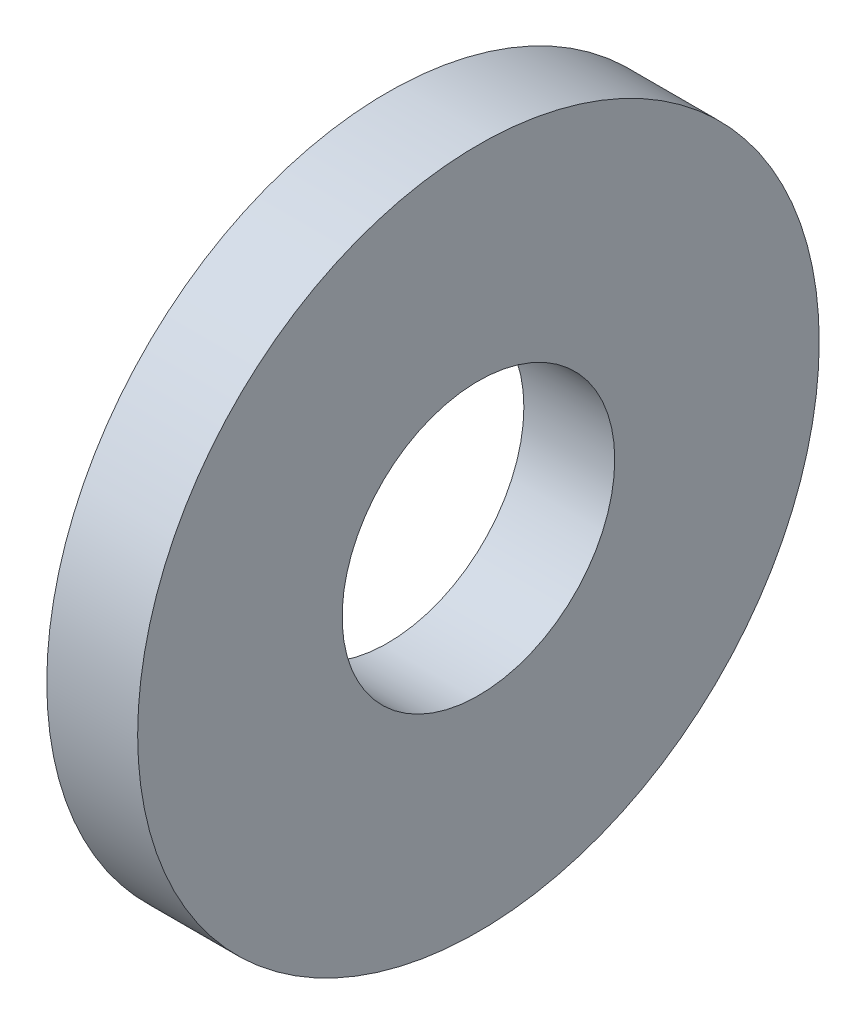
ISO-10303-21;
HEADER;
FILE_DESCRIPTION(('STEP AP214'),'2;1');
FILE_NAME('part.step','',(''),(''),'','','');
FILE_SCHEMA(('AUTOMOTIVE_DESIGN { 1 0 10303 214 1 1 1 1 }'));
ENDSEC;
DATA;
#1=APPLICATION_CONTEXT('core data for automotive mechanical design processes');
#2=APPLICATION_PROTOCOL_DEFINITION('international standard','automotive_design',2000,#1);
#3=PRODUCT_CONTEXT('',#1,'mechanical');
#4=PRODUCT('Part','Part','',(#3));
#5=PRODUCT_RELATED_PRODUCT_CATEGORY('part','',(#4));
#6=PRODUCT_DEFINITION_FORMATION('','',#4);
#7=PRODUCT_DEFINITION_CONTEXT('part definition',#1,'design');
#8=PRODUCT_DEFINITION('design','',#6,#7);
#9=PRODUCT_DEFINITION_SHAPE('','',#8);
#10=(LENGTH_UNIT() NAMED_UNIT(*) SI_UNIT(.MILLI.,.METRE.));
#11=(NAMED_UNIT(*) PLANE_ANGLE_UNIT() SI_UNIT($,.RADIAN.));
#12=(NAMED_UNIT(*) SI_UNIT($,.STERADIAN.) SOLID_ANGLE_UNIT());
#13=UNCERTAINTY_MEASURE_WITH_UNIT(LENGTH_MEASURE(1.E-05),#10,'distance_accuracy_value','');
#14=(GEOMETRIC_REPRESENTATION_CONTEXT(3) GLOBAL_UNCERTAINTY_ASSIGNED_CONTEXT((#13)) GLOBAL_UNIT_ASSIGNED_CONTEXT((#10,
#11,#12)) REPRESENTATION_CONTEXT('',''));
#15=CARTESIAN_POINT('',(0.,0.,0.));
#16=DIRECTION('',(0.,0.,1.));
#17=DIRECTION('',(1.,0.,0.));
#18=AXIS2_PLACEMENT_3D('',#15,#16,#17);
#19=CARTESIAN_POINT('',(2.,0.,0.));
#20=DIRECTION('',(-1.,0.,0.));
#21=DIRECTION('',(0.,0.,1.));
#22=AXIS2_PLACEMENT_3D('',#19,#20,#21);
#23=CYLINDRICAL_SURFACE('',#22,7.5);
#24=CARTESIAN_POINT('',(2.,0.,0.));
#25=DIRECTION('',(1.,0.,0.));
#26=DIRECTION('',(0.,0.,-1.));
#27=AXIS2_PLACEMENT_3D('',#24,#25,#26);
#28=CIRCLE('',#27,7.5);
#29=CARTESIAN_POINT('',(2.,0.,-7.5));
#30=VERTEX_POINT('',#29);
#31=EDGE_CURVE('E10',#30,#30,#28,.T.);
#32=ORIENTED_EDGE('',*,*,#31,.F.);
#33=EDGE_LOOP('',(#32));
#34=FACE_BOUND('',#33,.T.);
#35=CARTESIAN_POINT('',(0.,0.,0.));
#36=DIRECTION('',(1.,0.,0.));
#37=DIRECTION('',(0.,0.,-1.));
#38=AXIS2_PLACEMENT_3D('',#35,#36,#37);
#39=CIRCLE('',#38,7.5);
#40=CARTESIAN_POINT('',(0.,0.,-7.5));
#41=VERTEX_POINT('',#40);
#42=EDGE_CURVE('E34',#41,#41,#39,.T.);
#43=ORIENTED_EDGE('',*,*,#42,.T.);
#44=EDGE_LOOP('',(#43));
#45=FACE_BOUND('',#44,.T.);
#46=ADVANCED_FACE('F31',(#34,#45),#23,.T.);
#47=CARTESIAN_POINT('',(2.,0.,0.));
#48=DIRECTION('',(1.,0.,0.));
#49=DIRECTION('',(0.,0.,-1.));
#50=AXIS2_PLACEMENT_3D('',#47,#48,#49);
#51=PLANE('',#50);
#52=CARTESIAN_POINT('',(2.,0.,0.));
#53=DIRECTION('',(1.,0.,0.));
#54=DIRECTION('',(0.,0.,-1.));
#55=AXIS2_PLACEMENT_3D('',#52,#53,#54);
#56=CIRCLE('',#55,3.);
#57=CARTESIAN_POINT('',(2.,0.,-3.));
#58=VERTEX_POINT('',#57);
#59=EDGE_CURVE('E41',#58,#58,#56,.T.);
#60=ORIENTED_EDGE('',*,*,#59,.F.);
#61=EDGE_LOOP('',(#60));
#62=FACE_BOUND('',#61,.T.);
#63=ORIENTED_EDGE('',*,*,#31,.T.);
#64=EDGE_LOOP('',(#63));
#65=FACE_BOUND('',#64,.T.);
#66=ADVANCED_FACE('F59',(#62,#65),#51,.T.);
#67=CARTESIAN_POINT('',(0.,0.,0.));
#68=DIRECTION('',(1.,0.,0.));
#69=DIRECTION('',(0.,0.,-1.));
#70=AXIS2_PLACEMENT_3D('',#67,#68,#69);
#71=PLANE('',#70);
#72=CARTESIAN_POINT('',(0.,0.,0.));
#73=DIRECTION('',(1.,0.,0.));
#74=DIRECTION('',(0.,0.,-1.));
#75=AXIS2_PLACEMENT_3D('',#72,#73,#74);
#76=CIRCLE('',#75,3.);
#77=CARTESIAN_POINT('',(0.,0.,-3.));
#78=VERTEX_POINT('',#77);
#79=EDGE_CURVE('E45',#78,#78,#76,.T.);
#80=ORIENTED_EDGE('',*,*,#79,.T.);
#81=EDGE_LOOP('',(#80));
#82=FACE_BOUND('',#81,.T.);
#83=ORIENTED_EDGE('',*,*,#42,.F.);
#84=EDGE_LOOP('',(#83));
#85=FACE_BOUND('',#84,.T.);
#86=ADVANCED_FACE('F49',(#82,#85),#71,.F.);
#87=CARTESIAN_POINT('',(0.,0.,0.));
#88=DIRECTION('',(1.,0.,0.));
#89=DIRECTION('',(0.,0.,-1.));
#90=AXIS2_PLACEMENT_3D('',#87,#88,#89);
#91=CYLINDRICAL_SURFACE('',#90,3.);
#92=ORIENTED_EDGE('',*,*,#59,.T.);
#93=EDGE_LOOP('',(#92));
#94=FACE_BOUND('',#93,.T.);
#95=ORIENTED_EDGE('',*,*,#79,.F.);
#96=EDGE_LOOP('',(#95));
#97=FACE_BOUND('',#96,.T.);
#98=ADVANCED_FACE('F52',(#94,#97),#91,.F.);
#99=CLOSED_SHELL('',(#46,#66,#86,#98));
#100=MANIFOLD_SOLID_BREP('B2',#99);
#101=ADVANCED_BREP_SHAPE_REPRESENTATION('',(#18,#100),#14);
#102=SHAPE_DEFINITION_REPRESENTATION(#9,#101);
ENDSEC;
END-ISO-10303-21;
